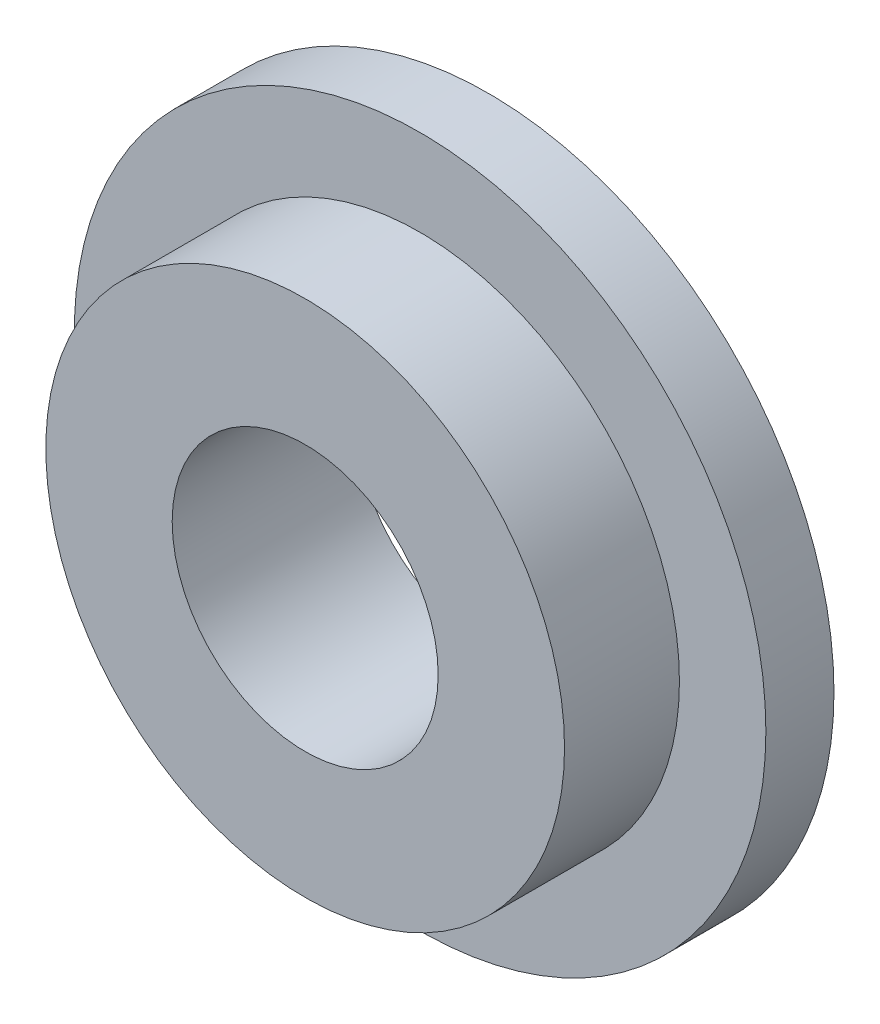
ISO-10303-21;
HEADER;
FILE_DESCRIPTION(('STEP AP214'),'2;1');
FILE_NAME('part.step','',(''),(''),'','','');
FILE_SCHEMA(('AUTOMOTIVE_DESIGN { 1 0 10303 214 1 1 1 1 }'));
ENDSEC;
DATA;
#1=APPLICATION_CONTEXT('core data for automotive mechanical design processes');
#2=APPLICATION_PROTOCOL_DEFINITION('international standard','automotive_design',2000,#1);
#3=PRODUCT_CONTEXT('',#1,'mechanical');
#4=PRODUCT('Part','Part','',(#3));
#5=PRODUCT_RELATED_PRODUCT_CATEGORY('part','',(#4));
#6=PRODUCT_DEFINITION_FORMATION('','',#4);
#7=PRODUCT_DEFINITION_CONTEXT('part definition',#1,'design');
#8=PRODUCT_DEFINITION('design','',#6,#7);
#9=PRODUCT_DEFINITION_SHAPE('','',#8);
#10=(LENGTH_UNIT() NAMED_UNIT(*) SI_UNIT(.MILLI.,.METRE.));
#11=(NAMED_UNIT(*) PLANE_ANGLE_UNIT() SI_UNIT($,.RADIAN.));
#12=(NAMED_UNIT(*) SI_UNIT($,.STERADIAN.) SOLID_ANGLE_UNIT());
#13=UNCERTAINTY_MEASURE_WITH_UNIT(LENGTH_MEASURE(1.E-05),#10,'distance_accuracy_value','');
#14=(GEOMETRIC_REPRESENTATION_CONTEXT(3) GLOBAL_UNCERTAINTY_ASSIGNED_CONTEXT((#13)) GLOBAL_UNIT_ASSIGNED_CONTEXT((#10,
#11,#12)) REPRESENTATION_CONTEXT('',''));
#15=CARTESIAN_POINT('',(0.,0.,0.));
#16=DIRECTION('',(0.,0.,1.));
#17=DIRECTION('',(1.,0.,0.));
#18=AXIS2_PLACEMENT_3D('',#15,#16,#17);
#19=CARTESIAN_POINT('',(0.,0.,4.064));
#20=DIRECTION('',(0.,0.,1.));
#21=DIRECTION('',(1.,0.,0.));
#22=AXIS2_PLACEMENT_3D('',#19,#20,#21);
#23=PLANE('',#22);
#24=CARTESIAN_POINT('',(0.,0.,4.064));
#25=DIRECTION('',(0.,0.,1.));
#26=DIRECTION('',(1.,0.,0.));
#27=AXIS2_PLACEMENT_3D('',#24,#25,#26);
#28=CIRCLE('',#27,20.6375);
#29=CARTESIAN_POINT('',(20.6375,0.,4.064));
#30=VERTEX_POINT('',#29);
#31=EDGE_CURVE('E10',#30,#30,#28,.T.);
#32=ORIENTED_EDGE('',*,*,#31,.T.);
#33=EDGE_LOOP('',(#32));
#34=FACE_BOUND('',#33,.T.);
#35=CARTESIAN_POINT('',(0.,0.,4.064));
#36=DIRECTION('',(0.,0.,1.));
#37=DIRECTION('',(1.,0.,0.));
#38=AXIS2_PLACEMENT_3D('',#35,#36,#37);
#39=CIRCLE('',#38,15.47876);
#40=CARTESIAN_POINT('',(15.47876,0.,4.064));
#41=VERTEX_POINT('',#40);
#42=EDGE_CURVE('E47',#41,#41,#39,.T.);
#43=ORIENTED_EDGE('',*,*,#42,.F.);
#44=EDGE_LOOP('',(#43));
#45=FACE_BOUND('',#44,.T.);
#46=ADVANCED_FACE('F31',(#34,#45),#23,.T.);
#47=CARTESIAN_POINT('',(0.,0.,0.));
#48=DIRECTION('',(0.,0.,1.));
#49=DIRECTION('',(1.,0.,0.));
#50=AXIS2_PLACEMENT_3D('',#47,#48,#49);
#51=PLANE('',#50);
#52=CARTESIAN_POINT('',(0.,0.,0.));
#53=DIRECTION('',(0.,0.,1.));
#54=DIRECTION('',(1.,0.,0.));
#55=AXIS2_PLACEMENT_3D('',#52,#53,#54);
#56=CIRCLE('',#55,20.6375);
#57=CARTESIAN_POINT('',(20.6375,0.,0.));
#58=VERTEX_POINT('',#57);
#59=EDGE_CURVE('E35',#58,#58,#56,.T.);
#60=ORIENTED_EDGE('',*,*,#59,.F.);
#61=EDGE_LOOP('',(#60));
#62=FACE_BOUND('',#61,.T.);
#63=CARTESIAN_POINT('',(0.,0.,0.));
#64=DIRECTION('',(0.,0.,1.));
#65=DIRECTION('',(1.,0.,0.));
#66=AXIS2_PLACEMENT_3D('',#63,#64,#65);
#67=CIRCLE('',#66,7.9375);
#68=CARTESIAN_POINT('',(7.9375,0.,0.));
#69=VERTEX_POINT('',#68);
#70=EDGE_CURVE('E42',#69,#69,#67,.T.);
#71=ORIENTED_EDGE('',*,*,#70,.T.);
#72=EDGE_LOOP('',(#71));
#73=FACE_BOUND('',#72,.T.);
#74=ADVANCED_FACE('F72',(#62,#73),#51,.F.);
#75=CARTESIAN_POINT('',(0.,0.,4.064));
#76=DIRECTION('',(0.,0.,-1.));
#77=DIRECTION('',(-1.,0.,0.));
#78=AXIS2_PLACEMENT_3D('',#75,#76,#77);
#79=CYLINDRICAL_SURFACE('',#78,20.6375);
#80=ORIENTED_EDGE('',*,*,#31,.F.);
#81=EDGE_LOOP('',(#80));
#82=FACE_BOUND('',#81,.T.);
#83=ORIENTED_EDGE('',*,*,#59,.T.);
#84=EDGE_LOOP('',(#83));
#85=FACE_BOUND('',#84,.T.);
#86=ADVANCED_FACE('F33',(#82,#85),#79,.T.);
#87=CARTESIAN_POINT('',(0.,0.,4.064));
#88=DIRECTION('',(0.,0.,-1.));
#89=DIRECTION('',(-1.,0.,0.));
#90=AXIS2_PLACEMENT_3D('',#87,#88,#89);
#91=CYLINDRICAL_SURFACE('',#90,7.9375);
#92=ORIENTED_EDGE('',*,*,#70,.F.);
#93=EDGE_LOOP('',(#92));
#94=FACE_BOUND('',#93,.T.);
#95=CARTESIAN_POINT('',(0.,0.,10.922));
#96=DIRECTION('',(0.,0.,1.));
#97=DIRECTION('',(1.,0.,0.));
#98=AXIS2_PLACEMENT_3D('',#95,#96,#97);
#99=CIRCLE('',#98,7.9375);
#100=CARTESIAN_POINT('',(7.9375,0.,10.922));
#101=VERTEX_POINT('',#100);
#102=EDGE_CURVE('E50',#101,#101,#99,.T.);
#103=ORIENTED_EDGE('',*,*,#102,.T.);
#104=EDGE_LOOP('',(#103));
#105=FACE_BOUND('',#104,.T.);
#106=ADVANCED_FACE('F56',(#94,#105),#91,.F.);
#107=CARTESIAN_POINT('',(0.,0.,10.922));
#108=DIRECTION('',(0.,0.,1.));
#109=DIRECTION('',(1.,0.,0.));
#110=AXIS2_PLACEMENT_3D('',#107,#108,#109);
#111=PLANE('',#110);
#112=CARTESIAN_POINT('',(0.,0.,10.922));
#113=DIRECTION('',(0.,0.,1.));
#114=DIRECTION('',(1.,0.,0.));
#115=AXIS2_PLACEMENT_3D('',#112,#113,#114);
#116=CIRCLE('',#115,15.47876);
#117=CARTESIAN_POINT('',(15.47876,0.,10.922));
#118=VERTEX_POINT('',#117);
#119=EDGE_CURVE('E46',#118,#118,#116,.T.);
#120=ORIENTED_EDGE('',*,*,#119,.T.);
#121=EDGE_LOOP('',(#120));
#122=FACE_BOUND('',#121,.T.);
#123=ORIENTED_EDGE('',*,*,#102,.F.);
#124=EDGE_LOOP('',(#123));
#125=FACE_BOUND('',#124,.T.);
#126=ADVANCED_FACE('F58',(#122,#125),#111,.T.);
#127=CARTESIAN_POINT('',(0.,0.,10.922));
#128=DIRECTION('',(0.,0.,-1.));
#129=DIRECTION('',(-1.,0.,0.));
#130=AXIS2_PLACEMENT_3D('',#127,#128,#129);
#131=CYLINDRICAL_SURFACE('',#130,15.47876);
#132=ORIENTED_EDGE('',*,*,#119,.F.);
#133=EDGE_LOOP('',(#132));
#134=FACE_BOUND('',#133,.T.);
#135=ORIENTED_EDGE('',*,*,#42,.T.);
#136=EDGE_LOOP('',(#135));
#137=FACE_BOUND('',#136,.T.);
#138=ADVANCED_FACE('F60',(#134,#137),#131,.T.);
#139=CLOSED_SHELL('',(#46,#74,#86,#106,#126,#138));
#140=MANIFOLD_SOLID_BREP('B2',#139);
#141=ADVANCED_BREP_SHAPE_REPRESENTATION('',(#18,#140),#14);
#142=SHAPE_DEFINITION_REPRESENTATION(#9,#141);
ENDSEC;
END-ISO-10303-21;
